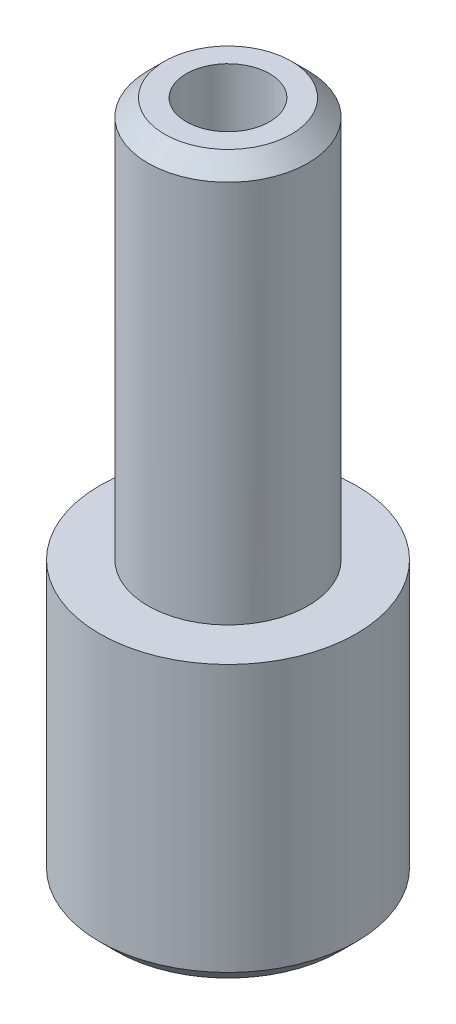
ISO-10303-21;
HEADER;
FILE_DESCRIPTION(('STEP AP214'),'2;1');
FILE_NAME('part.step','',(''),(''),'','','');
FILE_SCHEMA(('AUTOMOTIVE_DESIGN { 1 0 10303 214 1 1 1 1 }'));
ENDSEC;
DATA;
#1=APPLICATION_CONTEXT('core data for automotive mechanical design processes');
#2=APPLICATION_PROTOCOL_DEFINITION('international standard','automotive_design',2000,#1);
#3=PRODUCT_CONTEXT('',#1,'mechanical');
#4=PRODUCT('Part','Part','',(#3));
#5=PRODUCT_RELATED_PRODUCT_CATEGORY('part','',(#4));
#6=PRODUCT_DEFINITION_FORMATION('','',#4);
#7=PRODUCT_DEFINITION_CONTEXT('part definition',#1,'design');
#8=PRODUCT_DEFINITION('design','',#6,#7);
#9=PRODUCT_DEFINITION_SHAPE('','',#8);
#10=(LENGTH_UNIT() NAMED_UNIT(*) SI_UNIT(.MILLI.,.METRE.));
#11=(NAMED_UNIT(*) PLANE_ANGLE_UNIT() SI_UNIT($,.RADIAN.));
#12=(NAMED_UNIT(*) SI_UNIT($,.STERADIAN.) SOLID_ANGLE_UNIT());
#13=UNCERTAINTY_MEASURE_WITH_UNIT(LENGTH_MEASURE(1.E-05),#10,'distance_accuracy_value','');
#14=(GEOMETRIC_REPRESENTATION_CONTEXT(3) GLOBAL_UNCERTAINTY_ASSIGNED_CONTEXT((#13)) GLOBAL_UNIT_ASSIGNED_CONTEXT((#10,
#11,#12)) REPRESENTATION_CONTEXT('',''));
#15=CARTESIAN_POINT('',(0.,0.,0.));
#16=DIRECTION('',(0.,0.,1.));
#17=DIRECTION('',(1.,0.,0.));
#18=AXIS2_PLACEMENT_3D('',#15,#16,#17);
#19=CARTESIAN_POINT('',(3.85,0.,0.));
#20=DIRECTION('',(0.,1.,0.));
#21=DIRECTION('',(-1.,0.,0.));
#22=AXIS2_PLACEMENT_3D('',#19,#20,#21);
#23=PLANE('',#22);
#24=CARTESIAN_POINT('',(0.,0.,0.));
#25=DIRECTION('',(0.,1.,0.));
#26=DIRECTION('',(-1.,0.,0.));
#27=AXIS2_PLACEMENT_3D('',#24,#25,#26);
#28=CIRCLE('',#27,3.34999999999999);
#29=CARTESIAN_POINT('',(-3.34999999999999,0.,0.));
#30=VERTEX_POINT('',#29);
#31=EDGE_CURVE('E10',#30,#30,#28,.F.);
#32=ORIENTED_EDGE('',*,*,#31,.T.);
#33=EDGE_LOOP('',(#32));
#34=FACE_BOUND('',#33,.T.);
#35=CARTESIAN_POINT('',(0.,0.,0.));
#36=DIRECTION('',(0.,1.,0.));
#37=DIRECTION('',(-1.,0.,0.));
#38=AXIS2_PLACEMENT_3D('',#35,#36,#37);
#39=CIRCLE('',#38,1.25);
#40=CARTESIAN_POINT('',(-1.25,0.,0.));
#41=VERTEX_POINT('',#40);
#42=EDGE_CURVE('E50',#41,#41,#39,.T.);
#43=ORIENTED_EDGE('',*,*,#42,.T.);
#44=EDGE_LOOP('',(#43));
#45=FACE_BOUND('',#44,.T.);
#46=ADVANCED_FACE('F30',(#34,#45),#23,.F.);
#47=CARTESIAN_POINT('',(0.,9.71756756756758,0.));
#48=DIRECTION('',(0.,1.,0.));
#49=DIRECTION('',(-1.,0.,0.));
#50=AXIS2_PLACEMENT_3D('',#47,#48,#49);
#51=CYLINDRICAL_SURFACE('',#50,1.25);
#52=ORIENTED_EDGE('',*,*,#42,.F.);
#53=EDGE_LOOP('',(#52));
#54=FACE_BOUND('',#53,.T.);
#55=CARTESIAN_POINT('',(0.,20.5,0.));
#56=DIRECTION('',(0.,1.,0.));
#57=DIRECTION('',(-1.,0.,0.));
#58=AXIS2_PLACEMENT_3D('',#55,#56,#57);
#59=CIRCLE('',#58,1.25);
#60=CARTESIAN_POINT('',(-1.25,20.5,0.));
#61=VERTEX_POINT('',#60);
#62=EDGE_CURVE('E53',#61,#61,#59,.T.);
#63=ORIENTED_EDGE('',*,*,#62,.T.);
#64=EDGE_LOOP('',(#63));
#65=FACE_BOUND('',#64,.T.);
#66=ADVANCED_FACE('F78',(#54,#65),#51,.F.);
#67=CARTESIAN_POINT('',(1.25,20.5,0.));
#68=DIRECTION('',(0.,-1.,0.));
#69=DIRECTION('',(1.,0.,0.));
#70=AXIS2_PLACEMENT_3D('',#67,#68,#69);
#71=PLANE('',#70);
#72=CARTESIAN_POINT('',(0.,20.5,0.));
#73=DIRECTION('',(0.,-1.,0.));
#74=DIRECTION('',(1.,0.,0.));
#75=AXIS2_PLACEMENT_3D('',#72,#73,#74);
#76=CIRCLE('',#75,1.9);
#77=CARTESIAN_POINT('',(1.9,20.5,0.));
#78=VERTEX_POINT('',#77);
#79=EDGE_CURVE('E45',#78,#78,#76,.F.);
#80=ORIENTED_EDGE('',*,*,#79,.T.);
#81=EDGE_LOOP('',(#80));
#82=FACE_BOUND('',#81,.T.);
#83=ORIENTED_EDGE('',*,*,#62,.F.);
#84=EDGE_LOOP('',(#83));
#85=FACE_BOUND('',#84,.T.);
#86=ADVANCED_FACE('F83',(#82,#85),#71,.F.);
#87=CARTESIAN_POINT('',(0.,9.71756756756758,0.));
#88=DIRECTION('',(0.,1.,0.));
#89=DIRECTION('',(-1.,0.,0.));
#90=AXIS2_PLACEMENT_3D('',#87,#88,#89);
#91=CYLINDRICAL_SURFACE('',#90,2.4);
#92=CARTESIAN_POINT('',(0.,20.,0.));
#93=DIRECTION('',(0.,-1.,0.));
#94=DIRECTION('',(1.,0.,0.));
#95=AXIS2_PLACEMENT_3D('',#92,#93,#94);
#96=CIRCLE('',#95,2.4);
#97=CARTESIAN_POINT('',(2.4,20.,0.));
#98=VERTEX_POINT('',#97);
#99=EDGE_CURVE('E41',#98,#98,#96,.T.);
#100=ORIENTED_EDGE('',*,*,#99,.T.);
#101=EDGE_LOOP('',(#100));
#102=FACE_BOUND('',#101,.T.);
#103=CARTESIAN_POINT('',(0.,8.5,0.));
#104=DIRECTION('',(0.,1.,0.));
#105=DIRECTION('',(-1.,0.,0.));
#106=AXIS2_PLACEMENT_3D('',#103,#104,#105);
#107=CIRCLE('',#106,2.4);
#108=CARTESIAN_POINT('',(-2.4,8.5,0.));
#109=VERTEX_POINT('',#108);
#110=EDGE_CURVE('E56',#109,#109,#107,.T.);
#111=ORIENTED_EDGE('',*,*,#110,.T.);
#112=EDGE_LOOP('',(#111));
#113=FACE_BOUND('',#112,.T.);
#114=ADVANCED_FACE('F74',(#102,#113),#91,.T.);
#115=CARTESIAN_POINT('',(2.4,8.5,0.));
#116=DIRECTION('',(0.,-1.,0.));
#117=DIRECTION('',(1.,0.,0.));
#118=AXIS2_PLACEMENT_3D('',#115,#116,#117);
#119=PLANE('',#118);
#120=ORIENTED_EDGE('',*,*,#110,.F.);
#121=EDGE_LOOP('',(#120));
#122=FACE_BOUND('',#121,.T.);
#123=CARTESIAN_POINT('',(0.,8.5,0.));
#124=DIRECTION('',(0.,1.,0.));
#125=DIRECTION('',(-1.,0.,0.));
#126=AXIS2_PLACEMENT_3D('',#123,#124,#125);
#127=CIRCLE('',#126,3.85);
#128=CARTESIAN_POINT('',(-3.85,8.5,0.));
#129=VERTEX_POINT('',#128);
#130=EDGE_CURVE('E59',#129,#129,#127,.T.);
#131=ORIENTED_EDGE('',*,*,#130,.T.);
#132=EDGE_LOOP('',(#131));
#133=FACE_BOUND('',#132,.T.);
#134=ADVANCED_FACE('F63',(#122,#133),#119,.F.);
#135=CARTESIAN_POINT('',(0.,9.71756756756758,0.));
#136=DIRECTION('',(0.,1.,0.));
#137=DIRECTION('',(-1.,0.,0.));
#138=AXIS2_PLACEMENT_3D('',#135,#136,#137);
#139=CYLINDRICAL_SURFACE('',#138,3.85);
#140=CARTESIAN_POINT('',(0.,0.500000000000006,0.));
#141=DIRECTION('',(0.,1.,0.));
#142=DIRECTION('',(-1.,0.,0.));
#143=AXIS2_PLACEMENT_3D('',#140,#141,#142);
#144=CIRCLE('',#143,3.85);
#145=CARTESIAN_POINT('',(-3.85,0.500000000000005,0.));
#146=VERTEX_POINT('',#145);
#147=EDGE_CURVE('E37',#146,#146,#144,.T.);
#148=ORIENTED_EDGE('',*,*,#147,.T.);
#149=EDGE_LOOP('',(#148));
#150=FACE_BOUND('',#149,.T.);
#151=ORIENTED_EDGE('',*,*,#130,.F.);
#152=EDGE_LOOP('',(#151));
#153=FACE_BOUND('',#152,.T.);
#154=ADVANCED_FACE('F65',(#150,#153),#139,.T.);
#155=CARTESIAN_POINT('',(0.,20.5,0.));
#156=DIRECTION('',(0.,-1.,0.));
#157=DIRECTION('',(1.,0.,0.));
#158=AXIS2_PLACEMENT_3D('',#155,#156,#157);
#159=CONICAL_SURFACE('',#158,1.9,0.785398163397446);
#160=ORIENTED_EDGE('',*,*,#99,.F.);
#161=EDGE_LOOP('',(#160));
#162=FACE_BOUND('',#161,.T.);
#163=ORIENTED_EDGE('',*,*,#79,.F.);
#164=EDGE_LOOP('',(#163));
#165=FACE_BOUND('',#164,.T.);
#166=ADVANCED_FACE('F67',(#162,#165),#159,.T.);
#167=CARTESIAN_POINT('',(0.,0.500000000000006,0.));
#168=DIRECTION('',(0.,1.,0.));
#169=DIRECTION('',(-1.,0.,0.));
#170=AXIS2_PLACEMENT_3D('',#167,#168,#169);
#171=CONICAL_SURFACE('',#170,3.85,0.78539816339745);
#172=ORIENTED_EDGE('',*,*,#31,.F.);
#173=EDGE_LOOP('',(#172));
#174=FACE_BOUND('',#173,.T.);
#175=ORIENTED_EDGE('',*,*,#147,.F.);
#176=EDGE_LOOP('',(#175));
#177=FACE_BOUND('',#176,.T.);
#178=ADVANCED_FACE('F32',(#174,#177),#171,.T.);
#179=CLOSED_SHELL('',(#46,#66,#86,#114,#134,#154,#166,#178));
#180=MANIFOLD_SOLID_BREP('B2',#179);
#181=ADVANCED_BREP_SHAPE_REPRESENTATION('',(#18,#180),#14);
#182=SHAPE_DEFINITION_REPRESENTATION(#9,#181);
ENDSEC;
END-ISO-10303-21;
